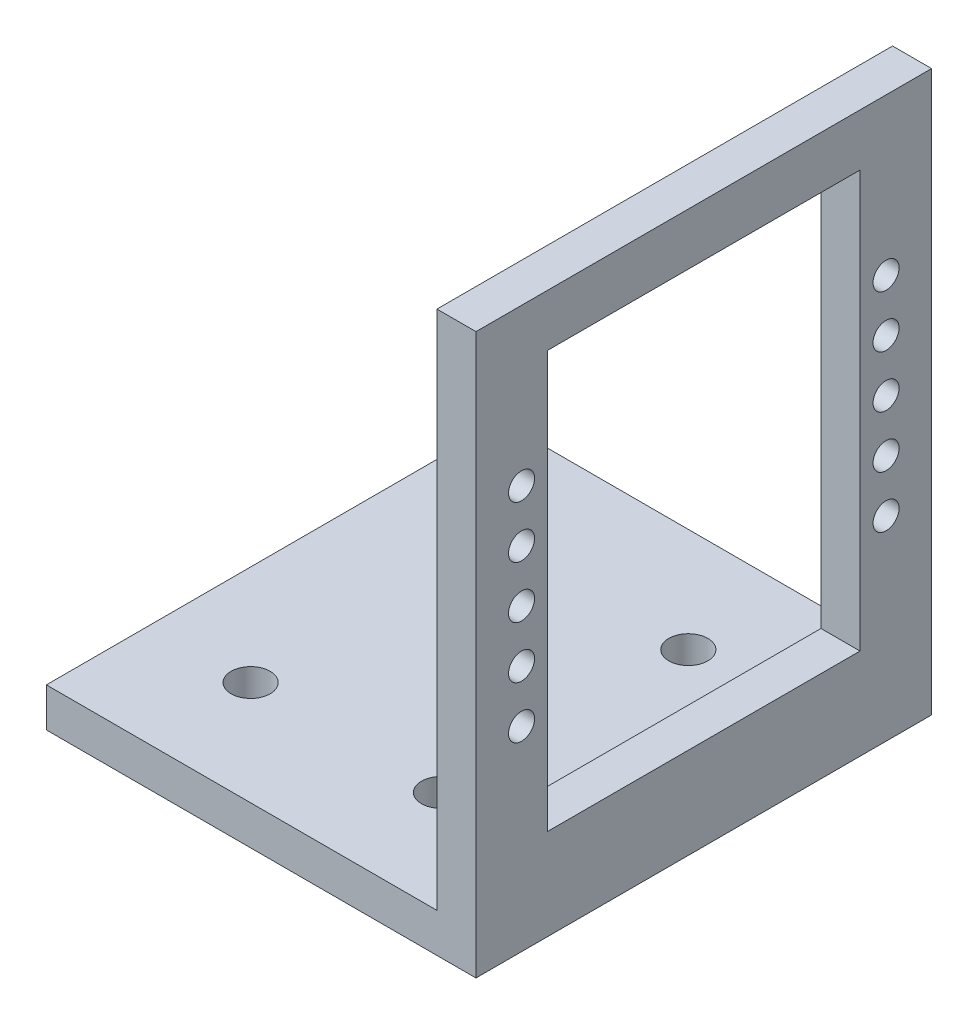
ISO-10303-21;
HEADER;
FILE_DESCRIPTION(('STEP AP214'),'2;1');
FILE_NAME('part.step','',(''),(''),'','','');
FILE_SCHEMA(('AUTOMOTIVE_DESIGN { 1 0 10303 214 1 1 1 1 }'));
ENDSEC;
DATA;
#1=APPLICATION_CONTEXT('core data for automotive mechanical design processes');
#2=APPLICATION_PROTOCOL_DEFINITION('international standard','automotive_design',2000,#1);
#3=PRODUCT_CONTEXT('',#1,'mechanical');
#4=PRODUCT('Part','Part','',(#3));
#5=PRODUCT_RELATED_PRODUCT_CATEGORY('part','',(#4));
#6=PRODUCT_DEFINITION_FORMATION('','',#4);
#7=PRODUCT_DEFINITION_CONTEXT('part definition',#1,'design');
#8=PRODUCT_DEFINITION('design','',#6,#7);
#9=PRODUCT_DEFINITION_SHAPE('','',#8);
#10=(LENGTH_UNIT() NAMED_UNIT(*) SI_UNIT(.MILLI.,.METRE.));
#11=(NAMED_UNIT(*) PLANE_ANGLE_UNIT() SI_UNIT($,.RADIAN.));
#12=(NAMED_UNIT(*) SI_UNIT($,.STERADIAN.) SOLID_ANGLE_UNIT());
#13=UNCERTAINTY_MEASURE_WITH_UNIT(LENGTH_MEASURE(1.E-05),#10,'distance_accuracy_value','');
#14=(GEOMETRIC_REPRESENTATION_CONTEXT(3) GLOBAL_UNCERTAINTY_ASSIGNED_CONTEXT((#13)) GLOBAL_UNIT_ASSIGNED_CONTEXT((#10,
#11,#12)) REPRESENTATION_CONTEXT('',''));
#15=CARTESIAN_POINT('',(0.,0.,0.));
#16=DIRECTION('',(0.,0.,1.));
#17=DIRECTION('',(1.,0.,0.));
#18=AXIS2_PLACEMENT_3D('',#15,#16,#17);
#19=CARTESIAN_POINT('',(0.,0.,35.));
#20=DIRECTION('',(-1.,0.,0.));
#21=DIRECTION('',(0.,-1.,0.));
#22=AXIS2_PLACEMENT_3D('',#19,#20,#21);
#23=PLANE('',#22);
#24=CARTESIAN_POINT('',(0.,15.,3.50000000000008));
#25=DIRECTION('',(-1.,0.,0.));
#26=DIRECTION('',(0.,-1.,0.));
#27=AXIS2_PLACEMENT_3D('',#24,#25,#26);
#28=CIRCLE('',#27,1.);
#29=CARTESIAN_POINT('',(0.,14.,3.50000000000008));
#30=VERTEX_POINT('',#29);
#31=EDGE_CURVE('E286',#30,#30,#28,.T.);
#32=ORIENTED_EDGE('',*,*,#31,.T.);
#33=EDGE_LOOP('',(#32));
#34=FACE_BOUND('',#33,.T.);
#35=CARTESIAN_POINT('',(0.,19.,3.50000000000004));
#36=DIRECTION('',(-1.,0.,0.));
#37=DIRECTION('',(0.,-1.,0.));
#38=AXIS2_PLACEMENT_3D('',#35,#36,#37);
#39=CIRCLE('',#38,0.999999999999999);
#40=CARTESIAN_POINT('',(0.,18.,3.50000000000004));
#41=VERTEX_POINT('',#40);
#42=EDGE_CURVE('E134',#41,#41,#39,.T.);
#43=ORIENTED_EDGE('',*,*,#42,.T.);
#44=EDGE_LOOP('',(#43));
#45=FACE_BOUND('',#44,.T.);
#46=CARTESIAN_POINT('',(0.,23.,3.5));
#47=DIRECTION('',(-1.,0.,0.));
#48=DIRECTION('',(0.,-1.,0.));
#49=AXIS2_PLACEMENT_3D('',#46,#47,#48);
#50=CIRCLE('',#49,1.);
#51=CARTESIAN_POINT('',(0.,22.,3.5));
#52=VERTEX_POINT('',#51);
#53=EDGE_CURVE('E319',#52,#52,#50,.T.);
#54=ORIENTED_EDGE('',*,*,#53,.T.);
#55=EDGE_LOOP('',(#54));
#56=FACE_BOUND('',#55,.T.);
#57=CARTESIAN_POINT('',(0.,27.,3.49999999999999));
#58=DIRECTION('',(-1.,0.,0.));
#59=DIRECTION('',(0.,-1.,0.));
#60=AXIS2_PLACEMENT_3D('',#57,#58,#59);
#61=CIRCLE('',#60,1.);
#62=CARTESIAN_POINT('',(0.,26.,3.49999999999999));
#63=VERTEX_POINT('',#62);
#64=EDGE_CURVE('E313',#63,#63,#61,.T.);
#65=ORIENTED_EDGE('',*,*,#64,.T.);
#66=EDGE_LOOP('',(#65));
#67=FACE_BOUND('',#66,.T.);
#68=CARTESIAN_POINT('',(0.,31.,3.49999999999997));
#69=DIRECTION('',(-1.,0.,0.));
#70=DIRECTION('',(0.,-1.,0.));
#71=AXIS2_PLACEMENT_3D('',#68,#69,#70);
#72=CIRCLE('',#71,1.);
#73=CARTESIAN_POINT('',(0.,30.,3.49999999999997));
#74=VERTEX_POINT('',#73);
#75=EDGE_CURVE('E307',#74,#74,#72,.T.);
#76=ORIENTED_EDGE('',*,*,#75,.T.);
#77=EDGE_LOOP('',(#76));
#78=FACE_BOUND('',#77,.T.);
#79=DIRECTION('',(0.,1.,0.));
#80=VECTOR('',#79,1.);
#81=CARTESIAN_POINT('',(0.,0.,0.));
#82=LINE('',#81,#80);
#83=CARTESIAN_POINT('',(0.,0.,0.));
#84=VERTEX_POINT('',#83);
#85=CARTESIAN_POINT('',(0.,43.,0.));
#86=VERTEX_POINT('',#85);
#87=EDGE_CURVE('E170',#84,#86,#82,.T.);
#88=ORIENTED_EDGE('',*,*,#87,.T.);
#89=DIRECTION('',(0.,0.,-1.));
#90=VECTOR('',#89,1.);
#91=CARTESIAN_POINT('',(0.,43.,35.));
#92=LINE('',#91,#90);
#93=CARTESIAN_POINT('',(0.,43.,35.));
#94=VERTEX_POINT('',#93);
#95=EDGE_CURVE('E185',#94,#86,#92,.T.);
#96=ORIENTED_EDGE('',*,*,#95,.F.);
#97=DIRECTION('',(0.,1.,0.));
#98=VECTOR('',#97,1.);
#99=CARTESIAN_POINT('',(0.,0.,35.));
#100=LINE('',#99,#98);
#101=CARTESIAN_POINT('',(0.,0.,35.));
#102=VERTEX_POINT('',#101);
#103=EDGE_CURVE('E157',#102,#94,#100,.T.);
#104=ORIENTED_EDGE('',*,*,#103,.F.);
#105=DIRECTION('',(0.,0.,-1.));
#106=VECTOR('',#105,1.);
#107=CARTESIAN_POINT('',(0.,0.,35.));
#108=LINE('',#107,#106);
#109=EDGE_CURVE('E42',#102,#84,#108,.T.);
#110=ORIENTED_EDGE('',*,*,#109,.T.);
#111=EDGE_LOOP('',(#88,#96,#104,#110));
#112=FACE_BOUND('',#111,.T.);
#113=DIRECTION('',(0.,-1.,0.));
#114=VECTOR('',#113,1.);
#115=CARTESIAN_POINT('',(0.,0.,29.5));
#116=LINE('',#115,#114);
#117=CARTESIAN_POINT('',(0.,39.,29.5));
#118=VERTEX_POINT('',#117);
#119=CARTESIAN_POINT('',(0.,7.,29.5));
#120=VERTEX_POINT('',#119);
#121=EDGE_CURVE('E119',#118,#120,#116,.T.);
#122=ORIENTED_EDGE('',*,*,#121,.F.);
#123=DIRECTION('',(0.,0.,1.));
#124=VECTOR('',#123,1.);
#125=CARTESIAN_POINT('',(0.,39.,0.));
#126=LINE('',#125,#124);
#127=CARTESIAN_POINT('',(0.,39.,5.50000000000001));
#128=VERTEX_POINT('',#127);
#129=EDGE_CURVE('E111',#128,#118,#126,.T.);
#130=ORIENTED_EDGE('',*,*,#129,.F.);
#131=DIRECTION('',(0.,-1.,0.));
#132=VECTOR('',#131,1.);
#133=CARTESIAN_POINT('',(0.,0.,5.5));
#134=LINE('',#133,#132);
#135=CARTESIAN_POINT('',(0.,7.,5.5));
#136=VERTEX_POINT('',#135);
#137=EDGE_CURVE('E49',#128,#136,#134,.T.);
#138=ORIENTED_EDGE('',*,*,#137,.T.);
#139=DIRECTION('',(0.,0.,1.));
#140=VECTOR('',#139,1.);
#141=CARTESIAN_POINT('',(0.,7.,0.));
#142=LINE('',#141,#140);
#143=EDGE_CURVE('E123',#136,#120,#142,.T.);
#144=ORIENTED_EDGE('',*,*,#143,.T.);
#145=EDGE_LOOP('',(#122,#130,#138,#144));
#146=FACE_BOUND('',#145,.T.);
#147=CARTESIAN_POINT('',(0.,31.,31.5));
#148=DIRECTION('',(1.,0.,0.));
#149=DIRECTION('',(0.,1.,0.));
#150=AXIS2_PLACEMENT_3D('',#147,#148,#149);
#151=CIRCLE('',#150,0.999999999999995);
#152=CARTESIAN_POINT('',(0.,32.,31.5));
#153=VERTEX_POINT('',#152);
#154=EDGE_CURVE('E262',#153,#153,#151,.T.);
#155=ORIENTED_EDGE('',*,*,#154,.F.);
#156=EDGE_LOOP('',(#155));
#157=FACE_BOUND('',#156,.T.);
#158=CARTESIAN_POINT('',(0.,27.,31.5));
#159=DIRECTION('',(1.,0.,0.));
#160=DIRECTION('',(0.,1.,0.));
#161=AXIS2_PLACEMENT_3D('',#158,#159,#160);
#162=CIRCLE('',#161,0.999999999999995);
#163=CARTESIAN_POINT('',(0.,28.,31.5));
#164=VERTEX_POINT('',#163);
#165=EDGE_CURVE('E278',#164,#164,#162,.T.);
#166=ORIENTED_EDGE('',*,*,#165,.F.);
#167=EDGE_LOOP('',(#166));
#168=FACE_BOUND('',#167,.T.);
#169=CARTESIAN_POINT('',(0.,15.,31.4999999999999));
#170=DIRECTION('',(1.,0.,0.));
#171=DIRECTION('',(0.,1.,0.));
#172=AXIS2_PLACEMENT_3D('',#169,#170,#171);
#173=CIRCLE('',#172,0.999999999999998);
#174=CARTESIAN_POINT('',(0.,16.,31.4999999999999));
#175=VERTEX_POINT('',#174);
#176=EDGE_CURVE('E291',#175,#175,#173,.T.);
#177=ORIENTED_EDGE('',*,*,#176,.F.);
#178=EDGE_LOOP('',(#177));
#179=FACE_BOUND('',#178,.T.);
#180=CARTESIAN_POINT('',(0.,19.,31.5));
#181=DIRECTION('',(1.,0.,0.));
#182=DIRECTION('',(0.,1.,0.));
#183=AXIS2_PLACEMENT_3D('',#180,#181,#182);
#184=CIRCLE('',#183,0.999999999999998);
#185=CARTESIAN_POINT('',(0.,20.,31.5));
#186=VERTEX_POINT('',#185);
#187=EDGE_CURVE('E297',#186,#186,#184,.T.);
#188=ORIENTED_EDGE('',*,*,#187,.F.);
#189=EDGE_LOOP('',(#188));
#190=FACE_BOUND('',#189,.T.);
#191=CARTESIAN_POINT('',(0.,23.,31.5));
#192=DIRECTION('',(1.,0.,0.));
#193=DIRECTION('',(0.,1.,0.));
#194=AXIS2_PLACEMENT_3D('',#191,#192,#193);
#195=CIRCLE('',#194,0.999999999999998);
#196=CARTESIAN_POINT('',(0.,24.,31.5));
#197=VERTEX_POINT('',#196);
#198=EDGE_CURVE('E277',#197,#197,#195,.T.);
#199=ORIENTED_EDGE('',*,*,#198,.F.);
#200=EDGE_LOOP('',(#199));
#201=FACE_BOUND('',#200,.T.);
#202=ADVANCED_FACE('F34',(#34,#45,#56,#67,#78,#112,#146,#157,#168,#179,#190,#201),#23,.F.);
#203=CARTESIAN_POINT('',(-3.,43.,35.));
#204=DIRECTION('',(1.,0.,0.));
#205=DIRECTION('',(0.,1.,0.));
#206=AXIS2_PLACEMENT_3D('',#203,#204,#205);
#207=PLANE('',#206);
#208=CARTESIAN_POINT('',(-3.,15.,3.50000000000008));
#209=DIRECTION('',(-1.,0.,0.));
#210=DIRECTION('',(0.,-1.,0.));
#211=AXIS2_PLACEMENT_3D('',#208,#209,#210);
#212=CIRCLE('',#211,1.);
#213=CARTESIAN_POINT('',(-3.,14.,3.50000000000008));
#214=VERTEX_POINT('',#213);
#215=EDGE_CURVE('E283',#214,#214,#212,.T.);
#216=ORIENTED_EDGE('',*,*,#215,.F.);
#217=EDGE_LOOP('',(#216));
#218=FACE_BOUND('',#217,.T.);
#219=CARTESIAN_POINT('',(-3.,19.,3.50000000000004));
#220=DIRECTION('',(-1.,0.,0.));
#221=DIRECTION('',(0.,-1.,0.));
#222=AXIS2_PLACEMENT_3D('',#219,#220,#221);
#223=CIRCLE('',#222,0.999999999999999);
#224=CARTESIAN_POINT('',(-3.,18.,3.50000000000004));
#225=VERTEX_POINT('',#224);
#226=EDGE_CURVE('E321',#225,#225,#223,.T.);
#227=ORIENTED_EDGE('',*,*,#226,.F.);
#228=EDGE_LOOP('',(#227));
#229=FACE_BOUND('',#228,.T.);
#230=CARTESIAN_POINT('',(-3.,23.,3.5));
#231=DIRECTION('',(-1.,0.,0.));
#232=DIRECTION('',(0.,-1.,0.));
#233=AXIS2_PLACEMENT_3D('',#230,#231,#232);
#234=CIRCLE('',#233,1.);
#235=CARTESIAN_POINT('',(-3.,22.,3.5));
#236=VERTEX_POINT('',#235);
#237=EDGE_CURVE('E316',#236,#236,#234,.T.);
#238=ORIENTED_EDGE('',*,*,#237,.F.);
#239=EDGE_LOOP('',(#238));
#240=FACE_BOUND('',#239,.T.);
#241=CARTESIAN_POINT('',(-3.,27.,3.49999999999999));
#242=DIRECTION('',(-1.,0.,0.));
#243=DIRECTION('',(0.,-1.,0.));
#244=AXIS2_PLACEMENT_3D('',#241,#242,#243);
#245=CIRCLE('',#244,1.);
#246=CARTESIAN_POINT('',(-3.,26.,3.49999999999999));
#247=VERTEX_POINT('',#246);
#248=EDGE_CURVE('E310',#247,#247,#245,.T.);
#249=ORIENTED_EDGE('',*,*,#248,.F.);
#250=EDGE_LOOP('',(#249));
#251=FACE_BOUND('',#250,.T.);
#252=CARTESIAN_POINT('',(-3.,31.,3.49999999999997));
#253=DIRECTION('',(-1.,0.,0.));
#254=DIRECTION('',(0.,-1.,0.));
#255=AXIS2_PLACEMENT_3D('',#252,#253,#254);
#256=CIRCLE('',#255,1.);
#257=CARTESIAN_POINT('',(-3.,30.,3.49999999999997));
#258=VERTEX_POINT('',#257);
#259=EDGE_CURVE('E141',#258,#258,#256,.T.);
#260=ORIENTED_EDGE('',*,*,#259,.F.);
#261=EDGE_LOOP('',(#260));
#262=FACE_BOUND('',#261,.T.);
#263=DIRECTION('',(0.,-1.,0.));
#264=VECTOR('',#263,1.);
#265=CARTESIAN_POINT('',(-3.,43.,0.));
#266=LINE('',#265,#264);
#267=CARTESIAN_POINT('',(-3.,43.,0.));
#268=VERTEX_POINT('',#267);
#269=CARTESIAN_POINT('',(-3.,3.,0.));
#270=VERTEX_POINT('',#269);
#271=EDGE_CURVE('E174',#268,#270,#266,.T.);
#272=ORIENTED_EDGE('',*,*,#271,.T.);
#273=DIRECTION('',(0.,0.,-1.));
#274=VECTOR('',#273,1.);
#275=CARTESIAN_POINT('',(-3.,3.,35.));
#276=LINE('',#275,#274);
#277=CARTESIAN_POINT('',(-3.,3.,35.));
#278=VERTEX_POINT('',#277);
#279=EDGE_CURVE('E179',#278,#270,#276,.T.);
#280=ORIENTED_EDGE('',*,*,#279,.F.);
#281=DIRECTION('',(0.,-1.,0.));
#282=VECTOR('',#281,1.);
#283=CARTESIAN_POINT('',(-3.,43.,35.));
#284=LINE('',#283,#282);
#285=CARTESIAN_POINT('',(-3.,43.,35.));
#286=VERTEX_POINT('',#285);
#287=EDGE_CURVE('E161',#286,#278,#284,.T.);
#288=ORIENTED_EDGE('',*,*,#287,.F.);
#289=DIRECTION('',(0.,0.,-1.));
#290=VECTOR('',#289,1.);
#291=CARTESIAN_POINT('',(-3.,43.,35.));
#292=LINE('',#291,#290);
#293=EDGE_CURVE('E182',#286,#268,#292,.T.);
#294=ORIENTED_EDGE('',*,*,#293,.T.);
#295=EDGE_LOOP('',(#272,#280,#288,#294));
#296=FACE_BOUND('',#295,.T.);
#297=DIRECTION('',(0.,-1.,0.));
#298=VECTOR('',#297,1.);
#299=CARTESIAN_POINT('',(-3.,0.,29.5));
#300=LINE('',#299,#298);
#301=CARTESIAN_POINT('',(-3.,39.,29.5));
#302=VERTEX_POINT('',#301);
#303=CARTESIAN_POINT('',(-3.,7.,29.5));
#304=VERTEX_POINT('',#303);
#305=EDGE_CURVE('E57',#302,#304,#300,.T.);
#306=ORIENTED_EDGE('',*,*,#305,.T.);
#307=DIRECTION('',(0.,0.,1.));
#308=VECTOR('',#307,1.);
#309=CARTESIAN_POINT('',(-3.,7.,0.));
#310=LINE('',#309,#308);
#311=CARTESIAN_POINT('',(-3.,7.,5.5));
#312=VERTEX_POINT('',#311);
#313=EDGE_CURVE('E128',#312,#304,#310,.T.);
#314=ORIENTED_EDGE('',*,*,#313,.F.);
#315=DIRECTION('',(0.,-1.,0.));
#316=VECTOR('',#315,1.);
#317=CARTESIAN_POINT('',(-3.,0.,5.5));
#318=LINE('',#317,#316);
#319=CARTESIAN_POINT('',(-3.,39.,5.5));
#320=VERTEX_POINT('',#319);
#321=EDGE_CURVE('E131',#320,#312,#318,.T.);
#322=ORIENTED_EDGE('',*,*,#321,.F.);
#323=DIRECTION('',(0.,0.,1.));
#324=VECTOR('',#323,1.);
#325=CARTESIAN_POINT('',(-3.,39.,0.));
#326=LINE('',#325,#324);
#327=EDGE_CURVE('E140',#320,#302,#326,.T.);
#328=ORIENTED_EDGE('',*,*,#327,.T.);
#329=EDGE_LOOP('',(#306,#314,#322,#328));
#330=FACE_BOUND('',#329,.T.);
#331=CARTESIAN_POINT('',(-3.,31.,31.5));
#332=DIRECTION('',(1.,0.,0.));
#333=DIRECTION('',(0.,1.,0.));
#334=AXIS2_PLACEMENT_3D('',#331,#332,#333);
#335=CIRCLE('',#334,0.999999999999995);
#336=CARTESIAN_POINT('',(-3.,32.,31.5));
#337=VERTEX_POINT('',#336);
#338=EDGE_CURVE('E266',#337,#337,#335,.T.);
#339=ORIENTED_EDGE('',*,*,#338,.T.);
#340=EDGE_LOOP('',(#339));
#341=FACE_BOUND('',#340,.T.);
#342=CARTESIAN_POINT('',(-3.,27.,31.5));
#343=DIRECTION('',(1.,0.,0.));
#344=DIRECTION('',(0.,1.,0.));
#345=AXIS2_PLACEMENT_3D('',#342,#343,#344);
#346=CIRCLE('',#345,0.999999999999995);
#347=CARTESIAN_POINT('',(-3.,28.,31.5));
#348=VERTEX_POINT('',#347);
#349=EDGE_CURVE('E274',#348,#348,#346,.T.);
#350=ORIENTED_EDGE('',*,*,#349,.T.);
#351=EDGE_LOOP('',(#350));
#352=FACE_BOUND('',#351,.T.);
#353=CARTESIAN_POINT('',(-3.,15.,31.4999999999999));
#354=DIRECTION('',(1.,0.,0.));
#355=DIRECTION('',(0.,1.,0.));
#356=AXIS2_PLACEMENT_3D('',#353,#354,#355);
#357=CIRCLE('',#356,0.999999999999998);
#358=CARTESIAN_POINT('',(-3.,16.,31.4999999999999));
#359=VERTEX_POINT('',#358);
#360=EDGE_CURVE('E288',#359,#359,#357,.T.);
#361=ORIENTED_EDGE('',*,*,#360,.T.);
#362=EDGE_LOOP('',(#361));
#363=FACE_BOUND('',#362,.T.);
#364=CARTESIAN_POINT('',(-3.,19.,31.5));
#365=DIRECTION('',(1.,0.,0.));
#366=DIRECTION('',(0.,1.,0.));
#367=AXIS2_PLACEMENT_3D('',#364,#365,#366);
#368=CIRCLE('',#367,0.999999999999998);
#369=CARTESIAN_POINT('',(-3.,20.,31.5));
#370=VERTEX_POINT('',#369);
#371=EDGE_CURVE('E294',#370,#370,#368,.T.);
#372=ORIENTED_EDGE('',*,*,#371,.T.);
#373=EDGE_LOOP('',(#372));
#374=FACE_BOUND('',#373,.T.);
#375=CARTESIAN_POINT('',(-3.,23.,31.5));
#376=DIRECTION('',(1.,0.,0.));
#377=DIRECTION('',(0.,1.,0.));
#378=AXIS2_PLACEMENT_3D('',#375,#376,#377);
#379=CIRCLE('',#378,0.999999999999998);
#380=CARTESIAN_POINT('',(-3.,24.,31.5));
#381=VERTEX_POINT('',#380);
#382=EDGE_CURVE('E300',#381,#381,#379,.T.);
#383=ORIENTED_EDGE('',*,*,#382,.T.);
#384=EDGE_LOOP('',(#383));
#385=FACE_BOUND('',#384,.T.);
#386=ADVANCED_FACE('F206',(#218,#229,#240,#251,#262,#296,#330,#341,#352,#363,#374,#385),#207,.F.);
#387=CARTESIAN_POINT('',(-33.,3.,35.));
#388=DIRECTION('',(1.,0.,0.));
#389=DIRECTION('',(0.,0.,-1.));
#390=AXIS2_PLACEMENT_3D('',#387,#388,#389);
#391=PLANE('',#390);
#392=DIRECTION('',(0.,-1.,0.));
#393=VECTOR('',#392,1.);
#394=CARTESIAN_POINT('',(-33.,3.,0.));
#395=LINE('',#394,#393);
#396=CARTESIAN_POINT('',(-33.,3.,0.));
#397=VERTEX_POINT('',#396);
#398=CARTESIAN_POINT('',(-33.,0.,0.));
#399=VERTEX_POINT('',#398);
#400=EDGE_CURVE('E147',#397,#399,#395,.T.);
#401=ORIENTED_EDGE('',*,*,#400,.T.);
#402=DIRECTION('',(0.,0.,-1.));
#403=VECTOR('',#402,1.);
#404=CARTESIAN_POINT('',(-33.,0.,35.));
#405=LINE('',#404,#403);
#406=CARTESIAN_POINT('',(-33.,0.,35.));
#407=VERTEX_POINT('',#406);
#408=EDGE_CURVE('E11',#407,#399,#405,.T.);
#409=ORIENTED_EDGE('',*,*,#408,.F.);
#410=DIRECTION('',(0.,-1.,0.));
#411=VECTOR('',#410,1.);
#412=CARTESIAN_POINT('',(-33.,3.,35.));
#413=LINE('',#412,#411);
#414=CARTESIAN_POINT('',(-33.,3.,35.));
#415=VERTEX_POINT('',#414);
#416=EDGE_CURVE('E151',#415,#407,#413,.T.);
#417=ORIENTED_EDGE('',*,*,#416,.F.);
#418=DIRECTION('',(0.,0.,-1.));
#419=VECTOR('',#418,1.);
#420=CARTESIAN_POINT('',(-33.,3.,35.));
#421=LINE('',#420,#419);
#422=EDGE_CURVE('E165',#415,#397,#421,.T.);
#423=ORIENTED_EDGE('',*,*,#422,.T.);
#424=EDGE_LOOP('',(#401,#409,#417,#423));
#425=FACE_BOUND('',#424,.T.);
#426=ADVANCED_FACE('F36',(#425),#391,.F.);
#427=CARTESIAN_POINT('',(-33.,0.,35.));
#428=DIRECTION('',(0.,1.,0.));
#429=DIRECTION('',(0.,0.,1.));
#430=AXIS2_PLACEMENT_3D('',#427,#428,#429);
#431=PLANE('',#430);
#432=CARTESIAN_POINT('',(-25.3109506728564,0.,27.));
#433=DIRECTION('',(0.,1.,0.));
#434=DIRECTION('',(1.,0.,0.));
#435=AXIS2_PLACEMENT_3D('',#432,#433,#434);
#436=CIRCLE('',#435,1.5);
#437=CARTESIAN_POINT('',(-23.8109506728563,0.,27.));
#438=VERTEX_POINT('',#437);
#439=EDGE_CURVE('E249',#438,#438,#436,.T.);
#440=ORIENTED_EDGE('',*,*,#439,.T.);
#441=EDGE_LOOP('',(#440));
#442=FACE_BOUND('',#441,.T.);
#443=CARTESIAN_POINT('',(-10.6890493271436,0.,27.));
#444=DIRECTION('',(0.,1.,0.));
#445=DIRECTION('',(-1.,0.,0.));
#446=AXIS2_PLACEMENT_3D('',#443,#444,#445);
#447=CIRCLE('',#446,1.5);
#448=CARTESIAN_POINT('',(-12.1890493271436,0.,27.));
#449=VERTEX_POINT('',#448);
#450=EDGE_CURVE('E253',#449,#449,#447,.T.);
#451=ORIENTED_EDGE('',*,*,#450,.T.);
#452=EDGE_LOOP('',(#451));
#453=FACE_BOUND('',#452,.T.);
#454=CARTESIAN_POINT('',(-10.6890493271436,0.,8.));
#455=DIRECTION('',(0.,1.,0.));
#456=DIRECTION('',(1.,0.,0.));
#457=AXIS2_PLACEMENT_3D('',#454,#455,#456);
#458=CIRCLE('',#457,1.5);
#459=CARTESIAN_POINT('',(-9.18904932714364,0.,8.));
#460=VERTEX_POINT('',#459);
#461=EDGE_CURVE('E257',#460,#460,#458,.T.);
#462=ORIENTED_EDGE('',*,*,#461,.T.);
#463=EDGE_LOOP('',(#462));
#464=FACE_BOUND('',#463,.T.);
#465=CARTESIAN_POINT('',(-25.3109506728564,0.,8.));
#466=DIRECTION('',(0.,1.,0.));
#467=DIRECTION('',(-1.,0.,0.));
#468=AXIS2_PLACEMENT_3D('',#465,#466,#467);
#469=CIRCLE('',#468,1.5);
#470=CARTESIAN_POINT('',(-26.8109506728564,0.,8.));
#471=VERTEX_POINT('',#470);
#472=EDGE_CURVE('E260',#471,#471,#469,.T.);
#473=ORIENTED_EDGE('',*,*,#472,.T.);
#474=EDGE_LOOP('',(#473));
#475=FACE_BOUND('',#474,.T.);
#476=DIRECTION('',(1.,0.,0.));
#477=VECTOR('',#476,1.);
#478=CARTESIAN_POINT('',(-33.,0.,0.));
#479=LINE('',#478,#477);
#480=EDGE_CURVE('E168',#399,#84,#479,.T.);
#481=ORIENTED_EDGE('',*,*,#480,.T.);
#482=ORIENTED_EDGE('',*,*,#109,.F.);
#483=DIRECTION('',(1.,0.,0.));
#484=VECTOR('',#483,1.);
#485=CARTESIAN_POINT('',(-33.,0.,35.));
#486=LINE('',#485,#484);
#487=EDGE_CURVE('E154',#407,#102,#486,.T.);
#488=ORIENTED_EDGE('',*,*,#487,.F.);
#489=ORIENTED_EDGE('',*,*,#408,.T.);
#490=EDGE_LOOP('',(#481,#482,#488,#489));
#491=FACE_BOUND('',#490,.T.);
#492=ADVANCED_FACE('F215',(#442,#453,#464,#475,#491),#431,.F.);
#493=CARTESIAN_POINT('',(0.,43.,35.));
#494=DIRECTION('',(0.,-1.,0.));
#495=DIRECTION('',(0.,0.,-1.));
#496=AXIS2_PLACEMENT_3D('',#493,#494,#495);
#497=PLANE('',#496);
#498=DIRECTION('',(-1.,0.,0.));
#499=VECTOR('',#498,1.);
#500=CARTESIAN_POINT('',(0.,43.,0.));
#501=LINE('',#500,#499);
#502=EDGE_CURVE('E172',#86,#268,#501,.T.);
#503=ORIENTED_EDGE('',*,*,#502,.T.);
#504=ORIENTED_EDGE('',*,*,#293,.F.);
#505=DIRECTION('',(-1.,0.,0.));
#506=VECTOR('',#505,1.);
#507=CARTESIAN_POINT('',(0.,43.,35.));
#508=LINE('',#507,#506);
#509=EDGE_CURVE('E159',#94,#286,#508,.T.);
#510=ORIENTED_EDGE('',*,*,#509,.F.);
#511=ORIENTED_EDGE('',*,*,#95,.T.);
#512=EDGE_LOOP('',(#503,#504,#510,#511));
#513=FACE_BOUND('',#512,.T.);
#514=ADVANCED_FACE('F202',(#513),#497,.F.);
#515=CARTESIAN_POINT('',(-3.,3.,35.));
#516=DIRECTION('',(0.,-1.,0.));
#517=DIRECTION('',(1.,0.,0.));
#518=AXIS2_PLACEMENT_3D('',#515,#516,#517);
#519=PLANE('',#518);
#520=CARTESIAN_POINT('',(-25.3109506728564,3.,27.));
#521=DIRECTION('',(0.,1.,0.));
#522=DIRECTION('',(1.,0.,0.));
#523=AXIS2_PLACEMENT_3D('',#520,#521,#522);
#524=CIRCLE('',#523,1.5);
#525=CARTESIAN_POINT('',(-23.8109506728563,3.,27.));
#526=VERTEX_POINT('',#525);
#527=EDGE_CURVE('E271',#526,#526,#524,.T.);
#528=ORIENTED_EDGE('',*,*,#527,.F.);
#529=EDGE_LOOP('',(#528));
#530=FACE_BOUND('',#529,.T.);
#531=CARTESIAN_POINT('',(-10.6890493271436,3.,27.));
#532=DIRECTION('',(0.,1.,0.));
#533=DIRECTION('',(-1.,0.,0.));
#534=AXIS2_PLACEMENT_3D('',#531,#532,#533);
#535=CIRCLE('',#534,1.5);
#536=CARTESIAN_POINT('',(-12.1890493271436,3.,27.));
#537=VERTEX_POINT('',#536);
#538=EDGE_CURVE('E507',#537,#537,#535,.T.);
#539=ORIENTED_EDGE('',*,*,#538,.F.);
#540=EDGE_LOOP('',(#539));
#541=FACE_BOUND('',#540,.T.);
#542=CARTESIAN_POINT('',(-10.6890493271436,3.,8.));
#543=DIRECTION('',(0.,1.,0.));
#544=DIRECTION('',(1.,0.,0.));
#545=AXIS2_PLACEMENT_3D('',#542,#543,#544);
#546=CIRCLE('',#545,1.5);
#547=CARTESIAN_POINT('',(-9.18904932714364,3.,8.));
#548=VERTEX_POINT('',#547);
#549=EDGE_CURVE('E512',#548,#548,#546,.T.);
#550=ORIENTED_EDGE('',*,*,#549,.F.);
#551=EDGE_LOOP('',(#550));
#552=FACE_BOUND('',#551,.T.);
#553=CARTESIAN_POINT('',(-25.3109506728564,3.,8.));
#554=DIRECTION('',(0.,1.,0.));
#555=DIRECTION('',(-1.,0.,0.));
#556=AXIS2_PLACEMENT_3D('',#553,#554,#555);
#557=CIRCLE('',#556,1.5);
#558=CARTESIAN_POINT('',(-26.8109506728564,3.,8.));
#559=VERTEX_POINT('',#558);
#560=EDGE_CURVE('E263',#559,#559,#557,.T.);
#561=ORIENTED_EDGE('',*,*,#560,.F.);
#562=EDGE_LOOP('',(#561));
#563=FACE_BOUND('',#562,.T.);
#564=DIRECTION('',(-1.,0.,0.));
#565=VECTOR('',#564,1.);
#566=CARTESIAN_POINT('',(-3.,3.,0.));
#567=LINE('',#566,#565);
#568=EDGE_CURVE('E155',#270,#397,#567,.T.);
#569=ORIENTED_EDGE('',*,*,#568,.T.);
#570=ORIENTED_EDGE('',*,*,#422,.F.);
#571=DIRECTION('',(-1.,0.,0.));
#572=VECTOR('',#571,1.);
#573=CARTESIAN_POINT('',(-3.,3.,35.));
#574=LINE('',#573,#572);
#575=EDGE_CURVE('E163',#278,#415,#574,.T.);
#576=ORIENTED_EDGE('',*,*,#575,.F.);
#577=ORIENTED_EDGE('',*,*,#279,.T.);
#578=EDGE_LOOP('',(#569,#570,#576,#577));
#579=FACE_BOUND('',#578,.T.);
#580=ADVANCED_FACE('F218',(#530,#541,#552,#563,#579),#519,.F.);
#581=CARTESIAN_POINT('',(0.,0.,35.));
#582=DIRECTION('',(0.,0.,1.));
#583=DIRECTION('',(1.,0.,0.));
#584=AXIS2_PLACEMENT_3D('',#581,#582,#583);
#585=PLANE('',#584);
#586=ORIENTED_EDGE('',*,*,#416,.T.);
#587=ORIENTED_EDGE('',*,*,#487,.T.);
#588=ORIENTED_EDGE('',*,*,#103,.T.);
#589=ORIENTED_EDGE('',*,*,#509,.T.);
#590=ORIENTED_EDGE('',*,*,#287,.T.);
#591=ORIENTED_EDGE('',*,*,#575,.T.);
#592=EDGE_LOOP('',(#586,#587,#588,#589,#590,#591));
#593=FACE_BOUND('',#592,.T.);
#594=ADVANCED_FACE('F211',(#593),#585,.T.);
#595=CARTESIAN_POINT('',(0.,0.,0.));
#596=DIRECTION('',(0.,0.,1.));
#597=DIRECTION('',(1.,0.,0.));
#598=AXIS2_PLACEMENT_3D('',#595,#596,#597);
#599=PLANE('',#598);
#600=ORIENTED_EDGE('',*,*,#400,.F.);
#601=ORIENTED_EDGE('',*,*,#568,.F.);
#602=ORIENTED_EDGE('',*,*,#271,.F.);
#603=ORIENTED_EDGE('',*,*,#502,.F.);
#604=ORIENTED_EDGE('',*,*,#87,.F.);
#605=ORIENTED_EDGE('',*,*,#480,.F.);
#606=EDGE_LOOP('',(#600,#601,#602,#603,#604,#605));
#607=FACE_BOUND('',#606,.T.);
#608=ADVANCED_FACE('F197',(#607),#599,.F.);
#609=CARTESIAN_POINT('',(0.,0.,29.5));
#610=DIRECTION('',(0.,0.,-1.));
#611=DIRECTION('',(-1.,0.,0.));
#612=AXIS2_PLACEMENT_3D('',#609,#610,#611);
#613=PLANE('',#612);
#614=ORIENTED_EDGE('',*,*,#305,.F.);
#615=DIRECTION('',(-1.,0.,0.));
#616=VECTOR('',#615,1.);
#617=CARTESIAN_POINT('',(0.,39.,29.5));
#618=LINE('',#617,#616);
#619=EDGE_CURVE('E114',#118,#302,#618,.T.);
#620=ORIENTED_EDGE('',*,*,#619,.F.);
#621=ORIENTED_EDGE('',*,*,#121,.T.);
#622=DIRECTION('',(-1.,0.,0.));
#623=VECTOR('',#622,1.);
#624=CARTESIAN_POINT('',(0.,7.,29.5));
#625=LINE('',#624,#623);
#626=EDGE_CURVE('E145',#120,#304,#625,.T.);
#627=ORIENTED_EDGE('',*,*,#626,.T.);
#628=EDGE_LOOP('',(#614,#620,#621,#627));
#629=FACE_BOUND('',#628,.T.);
#630=ADVANCED_FACE('F121',(#629),#613,.T.);
#631=CARTESIAN_POINT('',(0.,7.,0.));
#632=DIRECTION('',(0.,-1.,0.));
#633=DIRECTION('',(1.,0.,0.));
#634=AXIS2_PLACEMENT_3D('',#631,#632,#633);
#635=PLANE('',#634);
#636=ORIENTED_EDGE('',*,*,#313,.T.);
#637=ORIENTED_EDGE('',*,*,#626,.F.);
#638=ORIENTED_EDGE('',*,*,#143,.F.);
#639=DIRECTION('',(-1.,0.,0.));
#640=VECTOR('',#639,1.);
#641=CARTESIAN_POINT('',(0.,7.,5.5));
#642=LINE('',#641,#640);
#643=EDGE_CURVE('E148',#136,#312,#642,.T.);
#644=ORIENTED_EDGE('',*,*,#643,.T.);
#645=EDGE_LOOP('',(#636,#637,#638,#644));
#646=FACE_BOUND('',#645,.T.);
#647=ADVANCED_FACE('F346',(#646),#635,.F.);
#648=CARTESIAN_POINT('',(0.,0.,5.5));
#649=DIRECTION('',(0.,0.,-1.));
#650=DIRECTION('',(0.,1.,0.));
#651=AXIS2_PLACEMENT_3D('',#648,#649,#650);
#652=PLANE('',#651);
#653=ORIENTED_EDGE('',*,*,#321,.T.);
#654=ORIENTED_EDGE('',*,*,#643,.F.);
#655=ORIENTED_EDGE('',*,*,#137,.F.);
#656=DIRECTION('',(-1.,0.,0.));
#657=VECTOR('',#656,1.);
#658=CARTESIAN_POINT('',(0.,39.,5.5));
#659=LINE('',#658,#657);
#660=EDGE_CURVE('E116',#128,#320,#659,.T.);
#661=ORIENTED_EDGE('',*,*,#660,.T.);
#662=EDGE_LOOP('',(#653,#654,#655,#661));
#663=FACE_BOUND('',#662,.T.);
#664=ADVANCED_FACE('F349',(#663),#652,.F.);
#665=CARTESIAN_POINT('',(0.,39.,0.));
#666=DIRECTION('',(0.,-1.,0.));
#667=DIRECTION('',(1.,0.,0.));
#668=AXIS2_PLACEMENT_3D('',#665,#666,#667);
#669=PLANE('',#668);
#670=ORIENTED_EDGE('',*,*,#327,.F.);
#671=ORIENTED_EDGE('',*,*,#660,.F.);
#672=ORIENTED_EDGE('',*,*,#129,.T.);
#673=ORIENTED_EDGE('',*,*,#619,.T.);
#674=EDGE_LOOP('',(#670,#671,#672,#673));
#675=FACE_BOUND('',#674,.T.);
#676=ADVANCED_FACE('F113',(#675),#669,.T.);
#677=CARTESIAN_POINT('',(0.,31.,31.5));
#678=DIRECTION('',(-1.,0.,0.));
#679=DIRECTION('',(0.,-1.,0.));
#680=AXIS2_PLACEMENT_3D('',#677,#678,#679);
#681=CYLINDRICAL_SURFACE('',#680,0.999999999999995);
#682=ORIENTED_EDGE('',*,*,#154,.T.);
#683=EDGE_LOOP('',(#682));
#684=FACE_BOUND('',#683,.T.);
#685=ORIENTED_EDGE('',*,*,#338,.F.);
#686=EDGE_LOOP('',(#685));
#687=FACE_BOUND('',#686,.T.);
#688=ADVANCED_FACE('F355',(#684,#687),#681,.F.);
#689=CARTESIAN_POINT('',(0.,27.,31.5));
#690=DIRECTION('',(-1.,0.,0.));
#691=DIRECTION('',(0.,-1.,0.));
#692=AXIS2_PLACEMENT_3D('',#689,#690,#691);
#693=CYLINDRICAL_SURFACE('',#692,0.999999999999995);
#694=ORIENTED_EDGE('',*,*,#165,.T.);
#695=EDGE_LOOP('',(#694));
#696=FACE_BOUND('',#695,.T.);
#697=ORIENTED_EDGE('',*,*,#349,.F.);
#698=EDGE_LOOP('',(#697));
#699=FACE_BOUND('',#698,.T.);
#700=ADVANCED_FACE('F385',(#696,#699),#693,.F.);
#701=CARTESIAN_POINT('',(0.,31.,3.49999999999997));
#702=DIRECTION('',(-1.,0.,0.));
#703=DIRECTION('',(0.,-1.,0.));
#704=AXIS2_PLACEMENT_3D('',#701,#702,#703);
#705=CYLINDRICAL_SURFACE('',#704,1.);
#706=ORIENTED_EDGE('',*,*,#75,.F.);
#707=EDGE_LOOP('',(#706));
#708=FACE_BOUND('',#707,.T.);
#709=ORIENTED_EDGE('',*,*,#259,.T.);
#710=EDGE_LOOP('',(#709));
#711=FACE_BOUND('',#710,.T.);
#712=ADVANCED_FACE('F393',(#708,#711),#705,.F.);
#713=CARTESIAN_POINT('',(0.,27.,3.49999999999999));
#714=DIRECTION('',(-1.,0.,0.));
#715=DIRECTION('',(0.,-1.,0.));
#716=AXIS2_PLACEMENT_3D('',#713,#714,#715);
#717=CYLINDRICAL_SURFACE('',#716,1.);
#718=ORIENTED_EDGE('',*,*,#64,.F.);
#719=EDGE_LOOP('',(#718));
#720=FACE_BOUND('',#719,.T.);
#721=ORIENTED_EDGE('',*,*,#248,.T.);
#722=EDGE_LOOP('',(#721));
#723=FACE_BOUND('',#722,.T.);
#724=ADVANCED_FACE('F341',(#720,#723),#717,.F.);
#725=CARTESIAN_POINT('',(0.,23.,3.5));
#726=DIRECTION('',(-1.,0.,0.));
#727=DIRECTION('',(0.,-1.,0.));
#728=AXIS2_PLACEMENT_3D('',#725,#726,#727);
#729=CYLINDRICAL_SURFACE('',#728,1.);
#730=ORIENTED_EDGE('',*,*,#53,.F.);
#731=EDGE_LOOP('',(#730));
#732=FACE_BOUND('',#731,.T.);
#733=ORIENTED_EDGE('',*,*,#237,.T.);
#734=EDGE_LOOP('',(#733));
#735=FACE_BOUND('',#734,.T.);
#736=ADVANCED_FACE('F332',(#732,#735),#729,.F.);
#737=CARTESIAN_POINT('',(0.,19.,3.50000000000004));
#738=DIRECTION('',(-1.,0.,0.));
#739=DIRECTION('',(0.,-1.,0.));
#740=AXIS2_PLACEMENT_3D('',#737,#738,#739);
#741=CYLINDRICAL_SURFACE('',#740,0.999999999999999);
#742=ORIENTED_EDGE('',*,*,#42,.F.);
#743=EDGE_LOOP('',(#742));
#744=FACE_BOUND('',#743,.T.);
#745=ORIENTED_EDGE('',*,*,#226,.T.);
#746=EDGE_LOOP('',(#745));
#747=FACE_BOUND('',#746,.T.);
#748=ADVANCED_FACE('F329',(#744,#747),#741,.F.);
#749=CARTESIAN_POINT('',(0.,15.,3.50000000000008));
#750=DIRECTION('',(-1.,0.,0.));
#751=DIRECTION('',(0.,-1.,0.));
#752=AXIS2_PLACEMENT_3D('',#749,#750,#751);
#753=CYLINDRICAL_SURFACE('',#752,1.);
#754=ORIENTED_EDGE('',*,*,#31,.F.);
#755=EDGE_LOOP('',(#754));
#756=FACE_BOUND('',#755,.T.);
#757=ORIENTED_EDGE('',*,*,#215,.T.);
#758=EDGE_LOOP('',(#757));
#759=FACE_BOUND('',#758,.T.);
#760=ADVANCED_FACE('F331',(#756,#759),#753,.F.);
#761=CARTESIAN_POINT('',(0.,15.,31.4999999999999));
#762=DIRECTION('',(-1.,0.,0.));
#763=DIRECTION('',(0.,-1.,0.));
#764=AXIS2_PLACEMENT_3D('',#761,#762,#763);
#765=CYLINDRICAL_SURFACE('',#764,0.999999999999998);
#766=ORIENTED_EDGE('',*,*,#176,.T.);
#767=EDGE_LOOP('',(#766));
#768=FACE_BOUND('',#767,.T.);
#769=ORIENTED_EDGE('',*,*,#360,.F.);
#770=EDGE_LOOP('',(#769));
#771=FACE_BOUND('',#770,.T.);
#772=ADVANCED_FACE('F338',(#768,#771),#765,.F.);
#773=CARTESIAN_POINT('',(0.,19.,31.5));
#774=DIRECTION('',(-1.,0.,0.));
#775=DIRECTION('',(0.,-1.,0.));
#776=AXIS2_PLACEMENT_3D('',#773,#774,#775);
#777=CYLINDRICAL_SURFACE('',#776,0.999999999999998);
#778=ORIENTED_EDGE('',*,*,#187,.T.);
#779=EDGE_LOOP('',(#778));
#780=FACE_BOUND('',#779,.T.);
#781=ORIENTED_EDGE('',*,*,#371,.F.);
#782=EDGE_LOOP('',(#781));
#783=FACE_BOUND('',#782,.T.);
#784=ADVANCED_FACE('F431',(#780,#783),#777,.F.);
#785=CARTESIAN_POINT('',(0.,23.,31.5));
#786=DIRECTION('',(-1.,0.,0.));
#787=DIRECTION('',(0.,-1.,0.));
#788=AXIS2_PLACEMENT_3D('',#785,#786,#787);
#789=CYLINDRICAL_SURFACE('',#788,0.999999999999998);
#790=ORIENTED_EDGE('',*,*,#198,.T.);
#791=EDGE_LOOP('',(#790));
#792=FACE_BOUND('',#791,.T.);
#793=ORIENTED_EDGE('',*,*,#382,.F.);
#794=EDGE_LOOP('',(#793));
#795=FACE_BOUND('',#794,.T.);
#796=ADVANCED_FACE('F441',(#792,#795),#789,.F.);
#797=CARTESIAN_POINT('',(-25.3109506728564,0.,8.));
#798=DIRECTION('',(0.,1.,0.));
#799=DIRECTION('',(-1.,0.,0.));
#800=AXIS2_PLACEMENT_3D('',#797,#798,#799);
#801=CYLINDRICAL_SURFACE('',#800,1.5);
#802=ORIENTED_EDGE('',*,*,#472,.F.);
#803=EDGE_LOOP('',(#802));
#804=FACE_BOUND('',#803,.T.);
#805=ORIENTED_EDGE('',*,*,#560,.T.);
#806=EDGE_LOOP('',(#805));
#807=FACE_BOUND('',#806,.T.);
#808=ADVANCED_FACE('F450',(#804,#807),#801,.F.);
#809=CARTESIAN_POINT('',(-10.6890493271436,0.,8.));
#810=DIRECTION('',(0.,1.,0.));
#811=DIRECTION('',(-1.,0.,0.));
#812=AXIS2_PLACEMENT_3D('',#809,#810,#811);
#813=CYLINDRICAL_SURFACE('',#812,1.5);
#814=ORIENTED_EDGE('',*,*,#461,.F.);
#815=EDGE_LOOP('',(#814));
#816=FACE_BOUND('',#815,.T.);
#817=ORIENTED_EDGE('',*,*,#549,.T.);
#818=EDGE_LOOP('',(#817));
#819=FACE_BOUND('',#818,.T.);
#820=ADVANCED_FACE('F472',(#816,#819),#813,.F.);
#821=CARTESIAN_POINT('',(-10.6890493271436,0.,27.));
#822=DIRECTION('',(0.,1.,0.));
#823=DIRECTION('',(-1.,0.,0.));
#824=AXIS2_PLACEMENT_3D('',#821,#822,#823);
#825=CYLINDRICAL_SURFACE('',#824,1.5);
#826=ORIENTED_EDGE('',*,*,#450,.F.);
#827=EDGE_LOOP('',(#826));
#828=FACE_BOUND('',#827,.T.);
#829=ORIENTED_EDGE('',*,*,#538,.T.);
#830=EDGE_LOOP('',(#829));
#831=FACE_BOUND('',#830,.T.);
#832=ADVANCED_FACE('F481',(#828,#831),#825,.F.);
#833=CARTESIAN_POINT('',(-25.3109506728564,0.,27.));
#834=DIRECTION('',(0.,1.,0.));
#835=DIRECTION('',(-1.,0.,0.));
#836=AXIS2_PLACEMENT_3D('',#833,#834,#835);
#837=CYLINDRICAL_SURFACE('',#836,1.5);
#838=ORIENTED_EDGE('',*,*,#439,.F.);
#839=EDGE_LOOP('',(#838));
#840=FACE_BOUND('',#839,.T.);
#841=ORIENTED_EDGE('',*,*,#527,.T.);
#842=EDGE_LOOP('',(#841));
#843=FACE_BOUND('',#842,.T.);
#844=ADVANCED_FACE('F491',(#840,#843),#837,.F.);
#845=CLOSED_SHELL('',(#202,#386,#426,#492,#514,#580,#594,#608,#630,#647,#664,#676,#688,#700,
#712,#724,#736,#748,#760,#772,#784,#796,#808,#820,#832,#844));
#846=MANIFOLD_SOLID_BREP('B2',#845);
#847=ADVANCED_BREP_SHAPE_REPRESENTATION('',(#18,#846),#14);
#848=SHAPE_DEFINITION_REPRESENTATION(#9,#847);
ENDSEC;
END-ISO-10303-21;
